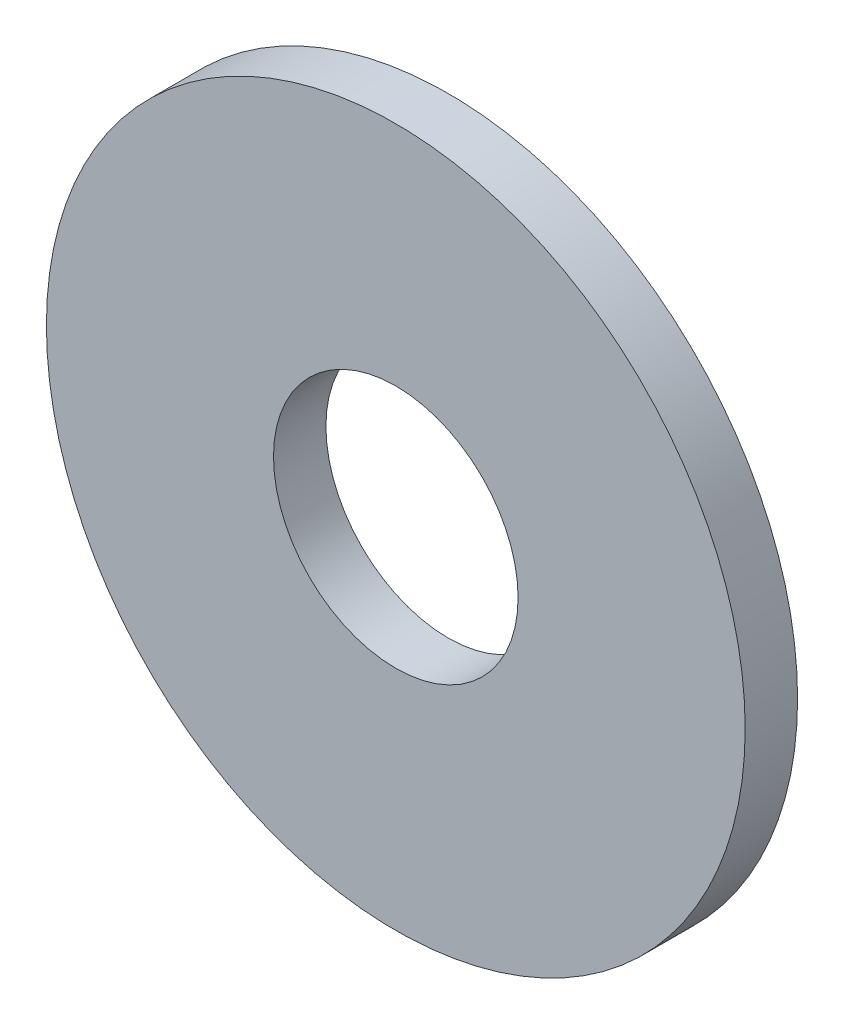
ISO-10303-21;
HEADER;
FILE_DESCRIPTION(('STEP AP214'),'2;1');
FILE_NAME('part.step','',(''),(''),'','','');
FILE_SCHEMA(('AUTOMOTIVE_DESIGN { 1 0 10303 214 1 1 1 1 }'));
ENDSEC;
DATA;
#1=APPLICATION_CONTEXT('core data for automotive mechanical design processes');
#2=APPLICATION_PROTOCOL_DEFINITION('international standard','automotive_design',2000,#1);
#3=PRODUCT_CONTEXT('',#1,'mechanical');
#4=PRODUCT('Part','Part','',(#3));
#5=PRODUCT_RELATED_PRODUCT_CATEGORY('part','',(#4));
#6=PRODUCT_DEFINITION_FORMATION('','',#4);
#7=PRODUCT_DEFINITION_CONTEXT('part definition',#1,'design');
#8=PRODUCT_DEFINITION('design','',#6,#7);
#9=PRODUCT_DEFINITION_SHAPE('','',#8);
#10=(LENGTH_UNIT() NAMED_UNIT(*) SI_UNIT(.MILLI.,.METRE.));
#11=(NAMED_UNIT(*) PLANE_ANGLE_UNIT() SI_UNIT($,.RADIAN.));
#12=(NAMED_UNIT(*) SI_UNIT($,.STERADIAN.) SOLID_ANGLE_UNIT());
#13=UNCERTAINTY_MEASURE_WITH_UNIT(LENGTH_MEASURE(1.E-05),#10,'distance_accuracy_value','');
#14=(GEOMETRIC_REPRESENTATION_CONTEXT(3) GLOBAL_UNCERTAINTY_ASSIGNED_CONTEXT((#13)) GLOBAL_UNIT_ASSIGNED_CONTEXT((#10,
#11,#12)) REPRESENTATION_CONTEXT('',''));
#15=CARTESIAN_POINT('',(0.,0.,0.));
#16=DIRECTION('',(0.,0.,1.));
#17=DIRECTION('',(1.,0.,0.));
#18=AXIS2_PLACEMENT_3D('',#15,#16,#17);
#19=CARTESIAN_POINT('',(0.,0.,-1.8));
#20=DIRECTION('',(0.,0.,1.));
#21=DIRECTION('',(1.,0.,0.));
#22=AXIS2_PLACEMENT_3D('',#19,#20,#21);
#23=CYLINDRICAL_SURFACE('',#22,12.);
#24=CARTESIAN_POINT('',(0.,0.,-1.8));
#25=DIRECTION('',(0.,0.,1.));
#26=DIRECTION('',(1.,0.,0.));
#27=AXIS2_PLACEMENT_3D('',#24,#25,#26);
#28=CIRCLE('',#27,12.);
#29=CARTESIAN_POINT('',(12.,0.,-1.8));
#30=VERTEX_POINT('',#29);
#31=EDGE_CURVE('E10',#30,#30,#28,.T.);
#32=ORIENTED_EDGE('',*,*,#31,.T.);
#33=EDGE_LOOP('',(#32));
#34=FACE_BOUND('',#33,.T.);
#35=CARTESIAN_POINT('',(0.,0.,0.));
#36=DIRECTION('',(0.,0.,1.));
#37=DIRECTION('',(1.,0.,0.));
#38=AXIS2_PLACEMENT_3D('',#35,#36,#37);
#39=CIRCLE('',#38,12.);
#40=CARTESIAN_POINT('',(12.,0.,0.));
#41=VERTEX_POINT('',#40);
#42=EDGE_CURVE('E31',#41,#41,#39,.T.);
#43=ORIENTED_EDGE('',*,*,#42,.F.);
#44=EDGE_LOOP('',(#43));
#45=FACE_BOUND('',#44,.T.);
#46=ADVANCED_FACE('F28',(#34,#45),#23,.T.);
#47=CARTESIAN_POINT('',(0.,0.,-1.8));
#48=DIRECTION('',(0.,0.,1.));
#49=DIRECTION('',(1.,0.,0.));
#50=AXIS2_PLACEMENT_3D('',#47,#48,#49);
#51=PLANE('',#50);
#52=CARTESIAN_POINT('',(0.,0.,-1.8));
#53=DIRECTION('',(0.,0.,1.));
#54=DIRECTION('',(1.,0.,0.));
#55=AXIS2_PLACEMENT_3D('',#52,#53,#54);
#56=CIRCLE('',#55,4.2);
#57=CARTESIAN_POINT('',(4.2,0.,-1.8));
#58=VERTEX_POINT('',#57);
#59=EDGE_CURVE('E38',#58,#58,#56,.T.);
#60=ORIENTED_EDGE('',*,*,#59,.T.);
#61=EDGE_LOOP('',(#60));
#62=FACE_BOUND('',#61,.T.);
#63=ORIENTED_EDGE('',*,*,#31,.F.);
#64=EDGE_LOOP('',(#63));
#65=FACE_BOUND('',#64,.T.);
#66=ADVANCED_FACE('F46',(#62,#65),#51,.F.);
#67=CARTESIAN_POINT('',(0.,0.,0.));
#68=DIRECTION('',(0.,0.,1.));
#69=DIRECTION('',(1.,0.,0.));
#70=AXIS2_PLACEMENT_3D('',#67,#68,#69);
#71=PLANE('',#70);
#72=CARTESIAN_POINT('',(0.,0.,0.));
#73=DIRECTION('',(0.,0.,1.));
#74=DIRECTION('',(1.,0.,0.));
#75=AXIS2_PLACEMENT_3D('',#72,#73,#74);
#76=CIRCLE('',#75,4.2);
#77=CARTESIAN_POINT('',(4.2,0.,0.));
#78=VERTEX_POINT('',#77);
#79=EDGE_CURVE('E40',#78,#78,#76,.T.);
#80=ORIENTED_EDGE('',*,*,#79,.F.);
#81=EDGE_LOOP('',(#80));
#82=FACE_BOUND('',#81,.T.);
#83=ORIENTED_EDGE('',*,*,#42,.T.);
#84=EDGE_LOOP('',(#83));
#85=FACE_BOUND('',#84,.T.);
#86=ADVANCED_FACE('F52',(#82,#85),#71,.T.);
#87=CARTESIAN_POINT('',(0.,0.,-1.8));
#88=DIRECTION('',(0.,0.,1.));
#89=DIRECTION('',(1.,0.,0.));
#90=AXIS2_PLACEMENT_3D('',#87,#88,#89);
#91=CYLINDRICAL_SURFACE('',#90,4.2);
#92=ORIENTED_EDGE('',*,*,#59,.F.);
#93=EDGE_LOOP('',(#92));
#94=FACE_BOUND('',#93,.T.);
#95=ORIENTED_EDGE('',*,*,#79,.T.);
#96=EDGE_LOOP('',(#95));
#97=FACE_BOUND('',#96,.T.);
#98=ADVANCED_FACE('F49',(#94,#97),#91,.F.);
#99=CLOSED_SHELL('',(#46,#66,#86,#98));
#100=MANIFOLD_SOLID_BREP('B2',#99);
#101=ADVANCED_BREP_SHAPE_REPRESENTATION('',(#18,#100),#14);
#102=SHAPE_DEFINITION_REPRESENTATION(#9,#101);
ENDSEC;
END-ISO-10303-21;
